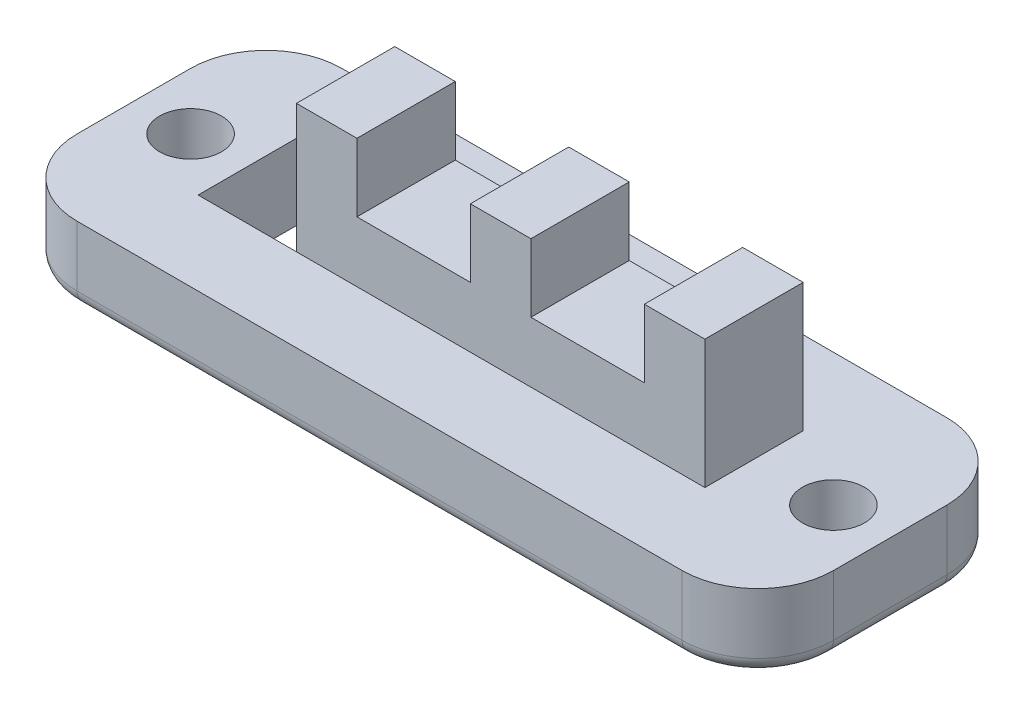
ISO-10303-21;
HEADER;
FILE_DESCRIPTION(('STEP AP214'),'2;1');
FILE_NAME('part.step','',(''),(''),'','','');
FILE_SCHEMA(('AUTOMOTIVE_DESIGN { 1 0 10303 214 1 1 1 1 }'));
ENDSEC;
DATA;
#1=APPLICATION_CONTEXT('core data for automotive mechanical design processes');
#2=APPLICATION_PROTOCOL_DEFINITION('international standard','automotive_design',2000,#1);
#3=PRODUCT_CONTEXT('',#1,'mechanical');
#4=PRODUCT('Part','Part','',(#3));
#5=PRODUCT_RELATED_PRODUCT_CATEGORY('part','',(#4));
#6=PRODUCT_DEFINITION_FORMATION('','',#4);
#7=PRODUCT_DEFINITION_CONTEXT('part definition',#1,'design');
#8=PRODUCT_DEFINITION('design','',#6,#7);
#9=PRODUCT_DEFINITION_SHAPE('','',#8);
#10=(LENGTH_UNIT() NAMED_UNIT(*) SI_UNIT(.MILLI.,.METRE.));
#11=(NAMED_UNIT(*) PLANE_ANGLE_UNIT() SI_UNIT($,.RADIAN.));
#12=(NAMED_UNIT(*) SI_UNIT($,.STERADIAN.) SOLID_ANGLE_UNIT());
#13=UNCERTAINTY_MEASURE_WITH_UNIT(LENGTH_MEASURE(1.E-05),#10,'distance_accuracy_value','');
#14=(GEOMETRIC_REPRESENTATION_CONTEXT(3) GLOBAL_UNCERTAINTY_ASSIGNED_CONTEXT((#13)) GLOBAL_UNIT_ASSIGNED_CONTEXT((#10,
#11,#12)) REPRESENTATION_CONTEXT('',''));
#15=CARTESIAN_POINT('',(0.,0.,0.));
#16=DIRECTION('',(0.,0.,1.));
#17=DIRECTION('',(1.,0.,0.));
#18=AXIS2_PLACEMENT_3D('',#15,#16,#17);
#19=CARTESIAN_POINT('',(0.,4.572,0.));
#20=DIRECTION('',(0.,-1.,0.));
#21=DIRECTION('',(0.,0.,-1.));
#22=AXIS2_PLACEMENT_3D('',#19,#20,#21);
#23=PLANE('',#22);
#24=DIRECTION('',(0.,0.,1.));
#25=VECTOR('',#24,1.);
#26=CARTESIAN_POINT('',(6.096,4.572,-1.651));
#27=LINE('',#26,#25);
#28=CARTESIAN_POINT('',(6.096,4.572,-1.651));
#29=VERTEX_POINT('',#28);
#30=CARTESIAN_POINT('',(6.096,4.572,1.651));
#31=VERTEX_POINT('',#30);
#32=EDGE_CURVE('E246',#29,#31,#27,.T.);
#33=ORIENTED_EDGE('',*,*,#32,.F.);
#34=DIRECTION('',(-1.,0.,0.));
#35=VECTOR('',#34,1.);
#36=CARTESIAN_POINT('',(-8.89,4.572,-1.651));
#37=LINE('',#36,#35);
#38=CARTESIAN_POINT('',(2.286,4.572,-1.651));
#39=VERTEX_POINT('',#38);
#40=EDGE_CURVE('E345',#29,#39,#37,.T.);
#41=ORIENTED_EDGE('',*,*,#40,.T.);
#42=DIRECTION('',(0.,0.,-1.));
#43=VECTOR('',#42,1.);
#44=CARTESIAN_POINT('',(2.286,4.572,-1.651));
#45=LINE('',#44,#43);
#46=CARTESIAN_POINT('',(2.286,4.572,1.651));
#47=VERTEX_POINT('',#46);
#48=EDGE_CURVE('E256',#47,#39,#45,.T.);
#49=ORIENTED_EDGE('',*,*,#48,.F.);
#50=DIRECTION('',(1.,0.,0.));
#51=VECTOR('',#50,1.);
#52=CARTESIAN_POINT('',(-8.89,4.572,1.651));
#53=LINE('',#52,#51);
#54=EDGE_CURVE('E347',#47,#31,#53,.T.);
#55=ORIENTED_EDGE('',*,*,#54,.T.);
#56=EDGE_LOOP('',(#33,#41,#49,#55));
#57=FACE_BOUND('',#56,.T.);
#58=ADVANCED_FACE('F43',(#57),#23,.F.);
#59=DIRECTION('',(0.,0.,1.));
#60=VECTOR('',#59,1.);
#61=CARTESIAN_POINT('',(0.253999999999999,4.572,-1.651));
#62=LINE('',#61,#60);
#63=CARTESIAN_POINT('',(0.253999999999999,4.572,-1.651));
#64=VERTEX_POINT('',#63);
#65=CARTESIAN_POINT('',(0.253999999999999,4.572,1.651));
#66=VERTEX_POINT('',#65);
#67=EDGE_CURVE('E250',#64,#66,#62,.T.);
#68=ORIENTED_EDGE('',*,*,#67,.F.);
#69=CARTESIAN_POINT('',(-3.556,4.572,-1.651));
#70=VERTEX_POINT('',#69);
#71=EDGE_CURVE('E348',#64,#70,#37,.T.);
#72=ORIENTED_EDGE('',*,*,#71,.T.);
#73=DIRECTION('',(0.,0.,-1.));
#74=VECTOR('',#73,1.);
#75=CARTESIAN_POINT('',(-3.556,4.572,-1.651));
#76=LINE('',#75,#74);
#77=CARTESIAN_POINT('',(-3.556,4.572,1.651));
#78=VERTEX_POINT('',#77);
#79=EDGE_CURVE('E284',#78,#70,#76,.T.);
#80=ORIENTED_EDGE('',*,*,#79,.F.);
#81=EDGE_CURVE('E349',#78,#66,#53,.T.);
#82=ORIENTED_EDGE('',*,*,#81,.T.);
#83=EDGE_LOOP('',(#68,#72,#80,#82));
#84=FACE_BOUND('',#83,.T.);
#85=ADVANCED_FACE('F499',(#84),#23,.F.);
#86=CARTESIAN_POINT('',(0.,2.54,0.));
#87=DIRECTION('',(0.,-1.,0.));
#88=DIRECTION('',(0.,0.,-1.));
#89=AXIS2_PLACEMENT_3D('',#86,#87,#88);
#90=PLANE('',#89);
#91=CARTESIAN_POINT('',(-10.795,2.54,0.));
#92=DIRECTION('',(0.,-1.,0.));
#93=DIRECTION('',(0.,0.,-1.));
#94=AXIS2_PLACEMENT_3D('',#91,#92,#93);
#95=CIRCLE('',#94,1.0414);
#96=CARTESIAN_POINT('',(-10.795,2.54,-1.0414));
#97=VERTEX_POINT('',#96);
#98=EDGE_CURVE('E341',#97,#97,#95,.T.);
#99=ORIENTED_EDGE('',*,*,#98,.T.);
#100=EDGE_LOOP('',(#99));
#101=FACE_BOUND('',#100,.T.);
#102=CARTESIAN_POINT('',(10.795,2.54,0.));
#103=DIRECTION('',(0.,-1.,0.));
#104=DIRECTION('',(0.,0.,-1.));
#105=AXIS2_PLACEMENT_3D('',#102,#103,#104);
#106=CIRCLE('',#105,1.0414);
#107=CARTESIAN_POINT('',(10.795,2.54,-1.0414));
#108=VERTEX_POINT('',#107);
#109=EDGE_CURVE('E336',#108,#108,#106,.T.);
#110=ORIENTED_EDGE('',*,*,#109,.T.);
#111=EDGE_LOOP('',(#110));
#112=FACE_BOUND('',#111,.T.);
#113=DIRECTION('',(1.,0.,0.));
#114=VECTOR('',#113,1.);
#115=CARTESIAN_POINT('',(-12.7,2.54,4.445));
#116=LINE('',#115,#114);
#117=CARTESIAN_POINT('',(-10.16,2.54,4.445));
#118=VERTEX_POINT('',#117);
#119=CARTESIAN_POINT('',(10.16,2.54,4.445));
#120=VERTEX_POINT('',#119);
#121=EDGE_CURVE('E376',#118,#120,#116,.T.);
#122=ORIENTED_EDGE('',*,*,#121,.T.);
#123=CARTESIAN_POINT('',(10.16,2.54,1.905));
#124=DIRECTION('',(0.,-1.,0.));
#125=DIRECTION('',(0.,0.,-1.));
#126=AXIS2_PLACEMENT_3D('',#123,#124,#125);
#127=CIRCLE('',#126,2.54);
#128=CARTESIAN_POINT('',(12.7,2.54,1.905));
#129=VERTEX_POINT('',#128);
#130=EDGE_CURVE('E394',#120,#129,#127,.F.);
#131=ORIENTED_EDGE('',*,*,#130,.T.);
#132=DIRECTION('',(0.,0.,-1.));
#133=VECTOR('',#132,1.);
#134=CARTESIAN_POINT('',(12.7,2.54,4.445));
#135=LINE('',#134,#133);
#136=CARTESIAN_POINT('',(12.7,2.54,-1.905));
#137=VERTEX_POINT('',#136);
#138=EDGE_CURVE('E366',#129,#137,#135,.T.);
#139=ORIENTED_EDGE('',*,*,#138,.T.);
#140=CARTESIAN_POINT('',(10.16,2.54,-1.905));
#141=DIRECTION('',(0.,-1.,0.));
#142=DIRECTION('',(0.,0.,-1.));
#143=AXIS2_PLACEMENT_3D('',#140,#141,#142);
#144=CIRCLE('',#143,2.54);
#145=CARTESIAN_POINT('',(10.16,2.54,-4.445));
#146=VERTEX_POINT('',#145);
#147=EDGE_CURVE('E392',#137,#146,#144,.F.);
#148=ORIENTED_EDGE('',*,*,#147,.T.);
#149=DIRECTION('',(-1.,0.,0.));
#150=VECTOR('',#149,1.);
#151=CARTESIAN_POINT('',(-12.7,2.54,-4.445));
#152=LINE('',#151,#150);
#153=CARTESIAN_POINT('',(-10.16,2.54,-4.445));
#154=VERTEX_POINT('',#153);
#155=EDGE_CURVE('E369',#146,#154,#152,.T.);
#156=ORIENTED_EDGE('',*,*,#155,.T.);
#157=CARTESIAN_POINT('',(-10.16,2.54,-1.905));
#158=DIRECTION('',(0.,-1.,0.));
#159=DIRECTION('',(0.,0.,-1.));
#160=AXIS2_PLACEMENT_3D('',#157,#158,#159);
#161=CIRCLE('',#160,2.54);
#162=CARTESIAN_POINT('',(-12.7,2.54,-1.905));
#163=VERTEX_POINT('',#162);
#164=EDGE_CURVE('E388',#154,#163,#161,.F.);
#165=ORIENTED_EDGE('',*,*,#164,.T.);
#166=DIRECTION('',(0.,0.,1.));
#167=VECTOR('',#166,1.);
#168=CARTESIAN_POINT('',(-12.7,2.54,4.445));
#169=LINE('',#168,#167);
#170=CARTESIAN_POINT('',(-12.7,2.54,1.905));
#171=VERTEX_POINT('',#170);
#172=EDGE_CURVE('E373',#163,#171,#169,.T.);
#173=ORIENTED_EDGE('',*,*,#172,.T.);
#174=CARTESIAN_POINT('',(-10.16,2.54,1.905));
#175=DIRECTION('',(0.,-1.,0.));
#176=DIRECTION('',(0.,0.,-1.));
#177=AXIS2_PLACEMENT_3D('',#174,#175,#176);
#178=CIRCLE('',#177,2.54);
#179=EDGE_CURVE('E390',#171,#118,#178,.F.);
#180=ORIENTED_EDGE('',*,*,#179,.T.);
#181=EDGE_LOOP('',(#122,#131,#139,#148,#156,#165,#173,#180));
#182=FACE_BOUND('',#181,.T.);
#183=DIRECTION('',(0.,0.,-1.));
#184=VECTOR('',#183,1.);
#185=CARTESIAN_POINT('',(8.128,2.54,1.651));
#186=LINE('',#185,#184);
#187=CARTESIAN_POINT('',(8.128,2.54,1.651));
#188=VERTEX_POINT('',#187);
#189=CARTESIAN_POINT('',(8.128,2.54,-1.651));
#190=VERTEX_POINT('',#189);
#191=EDGE_CURVE('E344',#188,#190,#186,.T.);
#192=ORIENTED_EDGE('',*,*,#191,.F.);
#193=DIRECTION('',(1.,0.,0.));
#194=VECTOR('',#193,1.);
#195=CARTESIAN_POINT('',(-8.89,2.54,1.651));
#196=LINE('',#195,#194);
#197=CARTESIAN_POINT('',(-5.588,2.54,1.651));
#198=VERTEX_POINT('',#197);
#199=EDGE_CURVE('E359',#198,#188,#196,.T.);
#200=ORIENTED_EDGE('',*,*,#199,.F.);
#201=CARTESIAN_POINT('',(-8.89,2.54,1.651));
#202=VERTEX_POINT('',#201);
#203=EDGE_CURVE('E360',#202,#198,#196,.T.);
#204=ORIENTED_EDGE('',*,*,#203,.F.);
#205=DIRECTION('',(0.,0.,1.));
#206=VECTOR('',#205,1.);
#207=CARTESIAN_POINT('',(-8.89,2.54,1.651));
#208=LINE('',#207,#206);
#209=CARTESIAN_POINT('',(-8.89,2.54,-1.651));
#210=VERTEX_POINT('',#209);
#211=EDGE_CURVE('E357',#210,#202,#208,.T.);
#212=ORIENTED_EDGE('',*,*,#211,.F.);
#213=DIRECTION('',(1.,0.,0.));
#214=VECTOR('',#213,1.);
#215=CARTESIAN_POINT('',(0.,2.54,-1.651));
#216=LINE('',#215,#214);
#217=CARTESIAN_POINT('',(-5.588,2.54,-1.651));
#218=VERTEX_POINT('',#217);
#219=EDGE_CURVE('E329',#210,#218,#216,.T.);
#220=ORIENTED_EDGE('',*,*,#219,.T.);
#221=DIRECTION('',(-1.,0.,0.));
#222=VECTOR('',#221,1.);
#223=CARTESIAN_POINT('',(-8.89,2.54,-1.651));
#224=LINE('',#223,#222);
#225=EDGE_CURVE('E353',#190,#218,#224,.T.);
#226=ORIENTED_EDGE('',*,*,#225,.F.);
#227=EDGE_LOOP('',(#192,#200,#204,#212,#220,#226));
#228=FACE_BOUND('',#227,.T.);
#229=ADVANCED_FACE('F484',(#101,#112,#182,#228),#90,.F.);
#230=CARTESIAN_POINT('',(12.7,2.54,4.445));
#231=DIRECTION('',(-1.,0.,0.));
#232=DIRECTION('',(0.,0.,1.));
#233=AXIS2_PLACEMENT_3D('',#230,#231,#232);
#234=PLANE('',#233);
#235=DIRECTION('',(0.,-1.,0.));
#236=VECTOR('',#235,1.);
#237=CARTESIAN_POINT('',(12.7,2.54,1.905));
#238=LINE('',#237,#236);
#239=CARTESIAN_POINT('',(12.7,0.508,1.905));
#240=VERTEX_POINT('',#239);
#241=EDGE_CURVE('E382',#129,#240,#238,.T.);
#242=ORIENTED_EDGE('',*,*,#241,.T.);
#243=DIRECTION('',(0.,0.,-1.));
#244=VECTOR('',#243,1.);
#245=CARTESIAN_POINT('',(12.7,0.508,-1.905));
#246=LINE('',#245,#244);
#247=CARTESIAN_POINT('',(12.7,0.508,-1.905));
#248=VERTEX_POINT('',#247);
#249=EDGE_CURVE('E434',#240,#248,#246,.T.);
#250=ORIENTED_EDGE('',*,*,#249,.T.);
#251=DIRECTION('',(0.,-1.,0.));
#252=VECTOR('',#251,1.);
#253=CARTESIAN_POINT('',(12.7,2.54,-1.905));
#254=LINE('',#253,#252);
#255=EDGE_CURVE('E380',#248,#137,#254,.F.);
#256=ORIENTED_EDGE('',*,*,#255,.T.);
#257=ORIENTED_EDGE('',*,*,#138,.F.);
#258=EDGE_LOOP('',(#242,#250,#256,#257));
#259=FACE_BOUND('',#258,.T.);
#260=ADVANCED_FACE('F526',(#259),#234,.F.);
#261=CARTESIAN_POINT('',(-12.7,2.54,-4.445));
#262=DIRECTION('',(0.,0.,1.));
#263=DIRECTION('',(1.,0.,0.));
#264=AXIS2_PLACEMENT_3D('',#261,#262,#263);
#265=PLANE('',#264);
#266=DIRECTION('',(0.,-1.,0.));
#267=VECTOR('',#266,1.);
#268=CARTESIAN_POINT('',(10.16,2.54,-4.445));
#269=LINE('',#268,#267);
#270=CARTESIAN_POINT('',(10.16,0.508,-4.445));
#271=VERTEX_POINT('',#270);
#272=EDGE_CURVE('E398',#146,#271,#269,.T.);
#273=ORIENTED_EDGE('',*,*,#272,.T.);
#274=DIRECTION('',(-1.,0.,0.));
#275=VECTOR('',#274,1.);
#276=CARTESIAN_POINT('',(-10.16,0.508,-4.445));
#277=LINE('',#276,#275);
#278=CARTESIAN_POINT('',(-10.16,0.508,-4.445));
#279=VERTEX_POINT('',#278);
#280=EDGE_CURVE('E430',#271,#279,#277,.T.);
#281=ORIENTED_EDGE('',*,*,#280,.T.);
#282=DIRECTION('',(0.,-1.,0.));
#283=VECTOR('',#282,1.);
#284=CARTESIAN_POINT('',(-10.16,2.54,-4.445));
#285=LINE('',#284,#283);
#286=EDGE_CURVE('E396',#279,#154,#285,.F.);
#287=ORIENTED_EDGE('',*,*,#286,.T.);
#288=ORIENTED_EDGE('',*,*,#155,.F.);
#289=EDGE_LOOP('',(#273,#281,#287,#288));
#290=FACE_BOUND('',#289,.T.);
#291=ADVANCED_FACE('F554',(#290),#265,.F.);
#292=CARTESIAN_POINT('',(-12.7,2.54,4.445));
#293=DIRECTION('',(1.,0.,0.));
#294=DIRECTION('',(0.,0.,-1.));
#295=AXIS2_PLACEMENT_3D('',#292,#293,#294);
#296=PLANE('',#295);
#297=DIRECTION('',(0.,-1.,0.));
#298=VECTOR('',#297,1.);
#299=CARTESIAN_POINT('',(-12.7,2.54,-1.905));
#300=LINE('',#299,#298);
#301=CARTESIAN_POINT('',(-12.7,0.508,-1.905));
#302=VERTEX_POINT('',#301);
#303=EDGE_CURVE('E401',#163,#302,#300,.T.);
#304=ORIENTED_EDGE('',*,*,#303,.T.);
#305=DIRECTION('',(0.,0.,1.));
#306=VECTOR('',#305,1.);
#307=CARTESIAN_POINT('',(-12.7,0.508,1.905));
#308=LINE('',#307,#306);
#309=CARTESIAN_POINT('',(-12.7,0.508,1.905));
#310=VERTEX_POINT('',#309);
#311=EDGE_CURVE('E426',#302,#310,#308,.T.);
#312=ORIENTED_EDGE('',*,*,#311,.T.);
#313=DIRECTION('',(0.,-1.,0.));
#314=VECTOR('',#313,1.);
#315=CARTESIAN_POINT('',(-12.7,2.54,1.905));
#316=LINE('',#315,#314);
#317=EDGE_CURVE('E404',#310,#171,#316,.F.);
#318=ORIENTED_EDGE('',*,*,#317,.T.);
#319=ORIENTED_EDGE('',*,*,#172,.F.);
#320=EDGE_LOOP('',(#304,#312,#318,#319));
#321=FACE_BOUND('',#320,.T.);
#322=ADVANCED_FACE('F565',(#321),#296,.F.);
#323=CARTESIAN_POINT('',(-12.7,2.54,4.445));
#324=DIRECTION('',(0.,0.,-1.));
#325=DIRECTION('',(-1.,0.,0.));
#326=AXIS2_PLACEMENT_3D('',#323,#324,#325);
#327=PLANE('',#326);
#328=DIRECTION('',(0.,-1.,0.));
#329=VECTOR('',#328,1.);
#330=CARTESIAN_POINT('',(-10.16,2.54,4.445));
#331=LINE('',#330,#329);
#332=CARTESIAN_POINT('',(-10.16,0.508,4.445));
#333=VERTEX_POINT('',#332);
#334=EDGE_CURVE('E384',#118,#333,#331,.T.);
#335=ORIENTED_EDGE('',*,*,#334,.T.);
#336=DIRECTION('',(1.,0.,0.));
#337=VECTOR('',#336,1.);
#338=CARTESIAN_POINT('',(10.16,0.508,4.445));
#339=LINE('',#338,#337);
#340=CARTESIAN_POINT('',(10.16,0.508,4.445));
#341=VERTEX_POINT('',#340);
#342=EDGE_CURVE('E11',#333,#341,#339,.T.);
#343=ORIENTED_EDGE('',*,*,#342,.T.);
#344=DIRECTION('',(0.,-1.,0.));
#345=VECTOR('',#344,1.);
#346=CARTESIAN_POINT('',(10.16,2.54,4.445));
#347=LINE('',#346,#345);
#348=EDGE_CURVE('E386',#341,#120,#347,.F.);
#349=ORIENTED_EDGE('',*,*,#348,.T.);
#350=ORIENTED_EDGE('',*,*,#121,.F.);
#351=EDGE_LOOP('',(#335,#343,#349,#350));
#352=FACE_BOUND('',#351,.T.);
#353=ADVANCED_FACE('F494',(#352),#327,.F.);
#354=CARTESIAN_POINT('',(0.,0.,0.));
#355=DIRECTION('',(0.,-1.,0.));
#356=DIRECTION('',(0.,0.,-1.));
#357=AXIS2_PLACEMENT_3D('',#354,#355,#356);
#358=PLANE('',#357);
#359=DIRECTION('',(1.,0.,0.));
#360=VECTOR('',#359,1.);
#361=CARTESIAN_POINT('',(-10.16,0.,3.937));
#362=LINE('',#361,#360);
#363=CARTESIAN_POINT('',(10.16,0.,3.937));
#364=VERTEX_POINT('',#363);
#365=CARTESIAN_POINT('',(-10.16,0.,3.937));
#366=VERTEX_POINT('',#365);
#367=EDGE_CURVE('E406',#364,#366,#362,.F.);
#368=ORIENTED_EDGE('',*,*,#367,.T.);
#369=CARTESIAN_POINT('',(-10.16,0.,1.905));
#370=DIRECTION('',(0.,-1.,0.));
#371=DIRECTION('',(0.,0.,-1.));
#372=AXIS2_PLACEMENT_3D('',#369,#370,#371);
#373=CIRCLE('',#372,2.032);
#374=CARTESIAN_POINT('',(-12.192,0.,1.905));
#375=VERTEX_POINT('',#374);
#376=EDGE_CURVE('E420',#366,#375,#373,.T.);
#377=ORIENTED_EDGE('',*,*,#376,.T.);
#378=DIRECTION('',(0.,0.,1.));
#379=VECTOR('',#378,1.);
#380=CARTESIAN_POINT('',(-12.192,0.,-1.905));
#381=LINE('',#380,#379);
#382=CARTESIAN_POINT('',(-12.192,0.,-1.905));
#383=VERTEX_POINT('',#382);
#384=EDGE_CURVE('E418',#375,#383,#381,.F.);
#385=ORIENTED_EDGE('',*,*,#384,.T.);
#386=CARTESIAN_POINT('',(-10.16,0.,-1.905));
#387=DIRECTION('',(0.,-1.,0.));
#388=DIRECTION('',(0.,0.,-1.));
#389=AXIS2_PLACEMENT_3D('',#386,#387,#388);
#390=CIRCLE('',#389,2.032);
#391=CARTESIAN_POINT('',(-10.16,0.,-3.937));
#392=VERTEX_POINT('',#391);
#393=EDGE_CURVE('E416',#383,#392,#390,.T.);
#394=ORIENTED_EDGE('',*,*,#393,.T.);
#395=DIRECTION('',(-1.,0.,0.));
#396=VECTOR('',#395,1.);
#397=CARTESIAN_POINT('',(10.16,0.,-3.937));
#398=LINE('',#397,#396);
#399=CARTESIAN_POINT('',(10.16,0.,-3.937));
#400=VERTEX_POINT('',#399);
#401=EDGE_CURVE('E414',#392,#400,#398,.F.);
#402=ORIENTED_EDGE('',*,*,#401,.T.);
#403=CARTESIAN_POINT('',(10.16,0.,-1.905));
#404=DIRECTION('',(0.,-1.,0.));
#405=DIRECTION('',(0.,0.,-1.));
#406=AXIS2_PLACEMENT_3D('',#403,#404,#405);
#407=CIRCLE('',#406,2.032);
#408=CARTESIAN_POINT('',(12.192,0.,-1.905));
#409=VERTEX_POINT('',#408);
#410=EDGE_CURVE('E412',#400,#409,#407,.T.);
#411=ORIENTED_EDGE('',*,*,#410,.T.);
#412=DIRECTION('',(0.,0.,-1.));
#413=VECTOR('',#412,1.);
#414=CARTESIAN_POINT('',(12.192,0.,1.905));
#415=LINE('',#414,#413);
#416=CARTESIAN_POINT('',(12.192,0.,1.905));
#417=VERTEX_POINT('',#416);
#418=EDGE_CURVE('E410',#409,#417,#415,.F.);
#419=ORIENTED_EDGE('',*,*,#418,.T.);
#420=CARTESIAN_POINT('',(10.16,0.,1.905));
#421=DIRECTION('',(0.,-1.,0.));
#422=DIRECTION('',(0.,0.,-1.));
#423=AXIS2_PLACEMENT_3D('',#420,#421,#422);
#424=CIRCLE('',#423,2.032);
#425=EDGE_CURVE('E408',#417,#364,#424,.T.);
#426=ORIENTED_EDGE('',*,*,#425,.T.);
#427=EDGE_LOOP('',(#368,#377,#385,#394,#402,#411,#419,#426));
#428=FACE_BOUND('',#427,.T.);
#429=DIRECTION('',(1.,0.,0.));
#430=VECTOR('',#429,1.);
#431=CARTESIAN_POINT('',(-8.89,0.,1.651));
#432=LINE('',#431,#430);
#433=CARTESIAN_POINT('',(-8.89,0.,1.651));
#434=VERTEX_POINT('',#433);
#435=CARTESIAN_POINT('',(-5.588,0.,1.651));
#436=VERTEX_POINT('',#435);
#437=EDGE_CURVE('E303',#434,#436,#432,.T.);
#438=ORIENTED_EDGE('',*,*,#437,.T.);
#439=DIRECTION('',(0.,0.,-1.));
#440=VECTOR('',#439,1.);
#441=CARTESIAN_POINT('',(-5.588,0.,1.651));
#442=LINE('',#441,#440);
#443=CARTESIAN_POINT('',(-5.588,0.,-1.651));
#444=VERTEX_POINT('',#443);
#445=EDGE_CURVE('E316',#436,#444,#442,.T.);
#446=ORIENTED_EDGE('',*,*,#445,.T.);
#447=DIRECTION('',(-1.,0.,0.));
#448=VECTOR('',#447,1.);
#449=CARTESIAN_POINT('',(-8.89,0.,-1.651));
#450=LINE('',#449,#448);
#451=CARTESIAN_POINT('',(-8.89,0.,-1.651));
#452=VERTEX_POINT('',#451);
#453=EDGE_CURVE('E312',#444,#452,#450,.T.);
#454=ORIENTED_EDGE('',*,*,#453,.T.);
#455=DIRECTION('',(0.,0.,1.));
#456=VECTOR('',#455,1.);
#457=CARTESIAN_POINT('',(-8.89,0.,1.651));
#458=LINE('',#457,#456);
#459=EDGE_CURVE('E307',#452,#434,#458,.T.);
#460=ORIENTED_EDGE('',*,*,#459,.T.);
#461=EDGE_LOOP('',(#438,#446,#454,#460));
#462=FACE_BOUND('',#461,.T.);
#463=CARTESIAN_POINT('',(-10.795,0.,0.));
#464=DIRECTION('',(0.,-1.,0.));
#465=DIRECTION('',(0.,0.,-1.));
#466=AXIS2_PLACEMENT_3D('',#463,#464,#465);
#467=CIRCLE('',#466,1.0414);
#468=CARTESIAN_POINT('',(-10.795,0.,-1.0414));
#469=VERTEX_POINT('',#468);
#470=EDGE_CURVE('E333',#469,#469,#467,.T.);
#471=ORIENTED_EDGE('',*,*,#470,.F.);
#472=EDGE_LOOP('',(#471));
#473=FACE_BOUND('',#472,.T.);
#474=CARTESIAN_POINT('',(10.795,0.,0.));
#475=DIRECTION('',(0.,-1.,0.));
#476=DIRECTION('',(0.,0.,-1.));
#477=AXIS2_PLACEMENT_3D('',#474,#475,#476);
#478=CIRCLE('',#477,1.0414);
#479=CARTESIAN_POINT('',(10.795,0.,-1.0414));
#480=VERTEX_POINT('',#479);
#481=EDGE_CURVE('E332',#480,#480,#478,.T.);
#482=ORIENTED_EDGE('',*,*,#481,.F.);
#483=EDGE_LOOP('',(#482));
#484=FACE_BOUND('',#483,.T.);
#485=ADVANCED_FACE('F487',(#428,#462,#473,#484),#358,.T.);
#486=CARTESIAN_POINT('',(8.128,4.572,1.651));
#487=DIRECTION('',(-1.,0.,0.));
#488=DIRECTION('',(0.,0.,1.));
#489=AXIS2_PLACEMENT_3D('',#486,#487,#488);
#490=PLANE('',#489);
#491=ORIENTED_EDGE('',*,*,#191,.T.);
#492=DIRECTION('',(0.,-1.,0.));
#493=VECTOR('',#492,1.);
#494=CARTESIAN_POINT('',(8.128,4.572,-1.651));
#495=LINE('',#494,#493);
#496=CARTESIAN_POINT('',(8.128,6.858,-1.651));
#497=VERTEX_POINT('',#496);
#498=EDGE_CURVE('E363',#497,#190,#495,.T.);
#499=ORIENTED_EDGE('',*,*,#498,.F.);
#500=DIRECTION('',(0.,0.,-1.));
#501=VECTOR('',#500,1.);
#502=CARTESIAN_POINT('',(8.128,6.858,-1.651));
#503=LINE('',#502,#501);
#504=CARTESIAN_POINT('',(8.128,6.858,1.651));
#505=VERTEX_POINT('',#504);
#506=EDGE_CURVE('E236',#505,#497,#503,.T.);
#507=ORIENTED_EDGE('',*,*,#506,.F.);
#508=DIRECTION('',(0.,-1.,0.));
#509=VECTOR('',#508,1.);
#510=CARTESIAN_POINT('',(8.128,4.572,1.651));
#511=LINE('',#510,#509);
#512=EDGE_CURVE('E232',#505,#188,#511,.T.);
#513=ORIENTED_EDGE('',*,*,#512,.T.);
#514=EDGE_LOOP('',(#491,#499,#507,#513));
#515=FACE_BOUND('',#514,.T.);
#516=ADVANCED_FACE('F485',(#515),#490,.F.);
#517=CARTESIAN_POINT('',(-8.89,4.572,-1.651));
#518=DIRECTION('',(0.,0.,1.));
#519=DIRECTION('',(1.,0.,0.));
#520=AXIS2_PLACEMENT_3D('',#517,#518,#519);
#521=PLANE('',#520);
#522=ORIENTED_EDGE('',*,*,#225,.T.);
#523=DIRECTION('',(0.,1.,0.));
#524=VECTOR('',#523,1.);
#525=CARTESIAN_POINT('',(-5.588,-4.66973318295596,-1.651));
#526=LINE('',#525,#524);
#527=CARTESIAN_POINT('',(-5.588,6.858,-1.651));
#528=VERTEX_POINT('',#527);
#529=EDGE_CURVE('E319',#218,#528,#526,.T.);
#530=ORIENTED_EDGE('',*,*,#529,.T.);
#531=DIRECTION('',(-1.,0.,0.));
#532=VECTOR('',#531,1.);
#533=CARTESIAN_POINT('',(-5.588,6.858,-1.651));
#534=LINE('',#533,#532);
#535=CARTESIAN_POINT('',(-3.556,6.858,-1.651));
#536=VERTEX_POINT('',#535);
#537=EDGE_CURVE('E292',#536,#528,#534,.T.);
#538=ORIENTED_EDGE('',*,*,#537,.F.);
#539=DIRECTION('',(0.,-1.,0.));
#540=VECTOR('',#539,1.);
#541=CARTESIAN_POINT('',(-3.556,6.858,-1.651));
#542=LINE('',#541,#540);
#543=EDGE_CURVE('E295',#536,#70,#542,.T.);
#544=ORIENTED_EDGE('',*,*,#543,.T.);
#545=ORIENTED_EDGE('',*,*,#71,.F.);
#546=DIRECTION('',(0.,-1.,0.));
#547=VECTOR('',#546,1.);
#548=CARTESIAN_POINT('',(0.253999999999999,6.858,-1.651));
#549=LINE('',#548,#547);
#550=CARTESIAN_POINT('',(0.253999999999999,6.858,-1.651));
#551=VERTEX_POINT('',#550);
#552=EDGE_CURVE('E269',#551,#64,#549,.T.);
#553=ORIENTED_EDGE('',*,*,#552,.F.);
#554=DIRECTION('',(-1.,0.,0.));
#555=VECTOR('',#554,1.);
#556=CARTESIAN_POINT('',(0.253999999999999,6.858,-1.651));
#557=LINE('',#556,#555);
#558=CARTESIAN_POINT('',(2.286,6.858,-1.651));
#559=VERTEX_POINT('',#558);
#560=EDGE_CURVE('E268',#559,#551,#557,.T.);
#561=ORIENTED_EDGE('',*,*,#560,.F.);
#562=DIRECTION('',(0.,-1.,0.));
#563=VECTOR('',#562,1.);
#564=CARTESIAN_POINT('',(2.286,6.858,-1.651));
#565=LINE('',#564,#563);
#566=EDGE_CURVE('E275',#559,#39,#565,.T.);
#567=ORIENTED_EDGE('',*,*,#566,.T.);
#568=ORIENTED_EDGE('',*,*,#40,.F.);
#569=DIRECTION('',(0.,-1.,0.));
#570=VECTOR('',#569,1.);
#571=CARTESIAN_POINT('',(6.096,6.858,-1.651));
#572=LINE('',#571,#570);
#573=CARTESIAN_POINT('',(6.096,6.858,-1.651));
#574=VERTEX_POINT('',#573);
#575=EDGE_CURVE('E251',#574,#29,#572,.T.);
#576=ORIENTED_EDGE('',*,*,#575,.F.);
#577=DIRECTION('',(-1.,0.,0.));
#578=VECTOR('',#577,1.);
#579=CARTESIAN_POINT('',(6.096,6.858,-1.651));
#580=LINE('',#579,#578);
#581=EDGE_CURVE('E242',#497,#574,#580,.T.);
#582=ORIENTED_EDGE('',*,*,#581,.F.);
#583=ORIENTED_EDGE('',*,*,#498,.T.);
#584=EDGE_LOOP('',(#522,#530,#538,#544,#545,#553,#561,#567,#568,#576,#582,#583));
#585=FACE_BOUND('',#584,.T.);
#586=ADVANCED_FACE('F467',(#585),#521,.F.);
#587=CARTESIAN_POINT('',(-8.89,4.572,1.651));
#588=DIRECTION('',(0.,0.,-1.));
#589=DIRECTION('',(-1.,0.,0.));
#590=AXIS2_PLACEMENT_3D('',#587,#588,#589);
#591=PLANE('',#590);
#592=ORIENTED_EDGE('',*,*,#81,.F.);
#593=DIRECTION('',(0.,-1.,0.));
#594=VECTOR('',#593,1.);
#595=CARTESIAN_POINT('',(-3.556,6.858,1.651));
#596=LINE('',#595,#594);
#597=CARTESIAN_POINT('',(-3.556,6.858,1.651));
#598=VERTEX_POINT('',#597);
#599=EDGE_CURVE('E300',#598,#78,#596,.T.);
#600=ORIENTED_EDGE('',*,*,#599,.F.);
#601=DIRECTION('',(1.,0.,0.));
#602=VECTOR('',#601,1.);
#603=CARTESIAN_POINT('',(-5.588,6.858,1.651));
#604=LINE('',#603,#602);
#605=CARTESIAN_POINT('',(-5.588,6.858,1.651));
#606=VERTEX_POINT('',#605);
#607=EDGE_CURVE('E288',#606,#598,#604,.T.);
#608=ORIENTED_EDGE('',*,*,#607,.F.);
#609=DIRECTION('',(0.,1.,0.));
#610=VECTOR('',#609,1.);
#611=CARTESIAN_POINT('',(-5.588,-4.66973318295596,1.651));
#612=LINE('',#611,#610);
#613=EDGE_CURVE('E306',#198,#606,#612,.T.);
#614=ORIENTED_EDGE('',*,*,#613,.F.);
#615=ORIENTED_EDGE('',*,*,#199,.T.);
#616=ORIENTED_EDGE('',*,*,#512,.F.);
#617=DIRECTION('',(1.,0.,0.));
#618=VECTOR('',#617,1.);
#619=CARTESIAN_POINT('',(6.096,6.858,1.651));
#620=LINE('',#619,#618);
#621=CARTESIAN_POINT('',(6.096,6.858,1.651));
#622=VERTEX_POINT('',#621);
#623=EDGE_CURVE('E224',#622,#505,#620,.T.);
#624=ORIENTED_EDGE('',*,*,#623,.F.);
#625=DIRECTION('',(0.,-1.,0.));
#626=VECTOR('',#625,1.);
#627=CARTESIAN_POINT('',(6.096,6.858,1.651));
#628=LINE('',#627,#626);
#629=EDGE_CURVE('E229',#622,#31,#628,.T.);
#630=ORIENTED_EDGE('',*,*,#629,.T.);
#631=ORIENTED_EDGE('',*,*,#54,.F.);
#632=DIRECTION('',(0.,-1.,0.));
#633=VECTOR('',#632,1.);
#634=CARTESIAN_POINT('',(2.286,6.858,1.651));
#635=LINE('',#634,#633);
#636=CARTESIAN_POINT('',(2.286,6.858,1.651));
#637=VERTEX_POINT('',#636);
#638=EDGE_CURVE('E278',#637,#47,#635,.T.);
#639=ORIENTED_EDGE('',*,*,#638,.F.);
#640=DIRECTION('',(1.,0.,0.));
#641=VECTOR('',#640,1.);
#642=CARTESIAN_POINT('',(0.253999999999999,6.858,1.651));
#643=LINE('',#642,#641);
#644=CARTESIAN_POINT('',(0.253999999999999,6.858,1.651));
#645=VERTEX_POINT('',#644);
#646=EDGE_CURVE('E264',#645,#637,#643,.T.);
#647=ORIENTED_EDGE('',*,*,#646,.F.);
#648=DIRECTION('',(0.,-1.,0.));
#649=VECTOR('',#648,1.);
#650=CARTESIAN_POINT('',(0.253999999999999,6.858,1.651));
#651=LINE('',#650,#649);
#652=EDGE_CURVE('E281',#645,#66,#651,.T.);
#653=ORIENTED_EDGE('',*,*,#652,.T.);
#654=EDGE_LOOP('',(#592,#600,#608,#614,#615,#616,#624,#630,#631,#639,#647,#653));
#655=FACE_BOUND('',#654,.T.);
#656=ADVANCED_FACE('F227',(#655),#591,.F.);
#657=CARTESIAN_POINT('',(10.795,4.572,0.));
#658=DIRECTION('',(0.,-1.,0.));
#659=DIRECTION('',(0.,0.,-1.));
#660=AXIS2_PLACEMENT_3D('',#657,#658,#659);
#661=CYLINDRICAL_SURFACE('',#660,1.0414);
#662=ORIENTED_EDGE('',*,*,#481,.T.);
#663=EDGE_LOOP('',(#662));
#664=FACE_BOUND('',#663,.T.);
#665=ORIENTED_EDGE('',*,*,#109,.F.);
#666=EDGE_LOOP('',(#665));
#667=FACE_BOUND('',#666,.T.);
#668=ADVANCED_FACE('F507',(#664,#667),#661,.F.);
#669=CARTESIAN_POINT('',(-10.795,4.572,0.));
#670=DIRECTION('',(0.,-1.,0.));
#671=DIRECTION('',(0.,0.,-1.));
#672=AXIS2_PLACEMENT_3D('',#669,#670,#671);
#673=CYLINDRICAL_SURFACE('',#672,1.0414);
#674=ORIENTED_EDGE('',*,*,#470,.T.);
#675=EDGE_LOOP('',(#674));
#676=FACE_BOUND('',#675,.T.);
#677=ORIENTED_EDGE('',*,*,#98,.F.);
#678=EDGE_LOOP('',(#677));
#679=FACE_BOUND('',#678,.T.);
#680=ADVANCED_FACE('F513',(#676,#679),#673,.F.);
#681=CARTESIAN_POINT('',(-8.89,-4.66973318295596,1.651));
#682=DIRECTION('',(0.,0.,1.));
#683=DIRECTION('',(1.,0.,0.));
#684=AXIS2_PLACEMENT_3D('',#681,#682,#683);
#685=PLANE('',#684);
#686=EDGE_CURVE('E320',#436,#198,#612,.T.);
#687=ORIENTED_EDGE('',*,*,#686,.F.);
#688=ORIENTED_EDGE('',*,*,#437,.F.);
#689=DIRECTION('',(0.,1.,0.));
#690=VECTOR('',#689,1.);
#691=CARTESIAN_POINT('',(-8.89,-4.66973318295596,1.651));
#692=LINE('',#691,#690);
#693=EDGE_CURVE('E310',#434,#202,#692,.T.);
#694=ORIENTED_EDGE('',*,*,#693,.T.);
#695=ORIENTED_EDGE('',*,*,#203,.T.);
#696=EDGE_LOOP('',(#687,#688,#694,#695));
#697=FACE_BOUND('',#696,.T.);
#698=ADVANCED_FACE('F518',(#697),#685,.F.);
#699=CARTESIAN_POINT('',(-8.89,-4.66973318295596,-1.651));
#700=DIRECTION('',(0.,0.,-1.));
#701=DIRECTION('',(-1.,0.,0.));
#702=AXIS2_PLACEMENT_3D('',#699,#700,#701);
#703=PLANE('',#702);
#704=DIRECTION('',(0.,1.,0.));
#705=VECTOR('',#704,1.);
#706=CARTESIAN_POINT('',(-8.89,-4.66973318295596,-1.651));
#707=LINE('',#706,#705);
#708=EDGE_CURVE('E311',#452,#210,#707,.T.);
#709=ORIENTED_EDGE('',*,*,#708,.F.);
#710=ORIENTED_EDGE('',*,*,#453,.F.);
#711=EDGE_CURVE('E315',#444,#218,#526,.T.);
#712=ORIENTED_EDGE('',*,*,#711,.T.);
#713=ORIENTED_EDGE('',*,*,#219,.F.);
#714=EDGE_LOOP('',(#709,#710,#712,#713));
#715=FACE_BOUND('',#714,.T.);
#716=ADVANCED_FACE('F704',(#715),#703,.F.);
#717=CARTESIAN_POINT('',(-8.89,-4.66973318295596,1.651));
#718=DIRECTION('',(-1.,0.,0.));
#719=DIRECTION('',(0.,0.,1.));
#720=AXIS2_PLACEMENT_3D('',#717,#718,#719);
#721=PLANE('',#720);
#722=ORIENTED_EDGE('',*,*,#693,.F.);
#723=ORIENTED_EDGE('',*,*,#459,.F.);
#724=ORIENTED_EDGE('',*,*,#708,.T.);
#725=ORIENTED_EDGE('',*,*,#211,.T.);
#726=EDGE_LOOP('',(#722,#723,#724,#725));
#727=FACE_BOUND('',#726,.T.);
#728=ADVANCED_FACE('F695',(#727),#721,.F.);
#729=CARTESIAN_POINT('',(-5.588,-4.66973318295596,1.651));
#730=DIRECTION('',(1.,0.,0.));
#731=DIRECTION('',(0.,0.,-1.));
#732=AXIS2_PLACEMENT_3D('',#729,#730,#731);
#733=PLANE('',#732);
#734=ORIENTED_EDGE('',*,*,#686,.T.);
#735=ORIENTED_EDGE('',*,*,#613,.T.);
#736=DIRECTION('',(0.,0.,1.));
#737=VECTOR('',#736,1.);
#738=CARTESIAN_POINT('',(-5.588,6.858,-1.651));
#739=LINE('',#738,#737);
#740=EDGE_CURVE('E285',#528,#606,#739,.T.);
#741=ORIENTED_EDGE('',*,*,#740,.F.);
#742=ORIENTED_EDGE('',*,*,#529,.F.);
#743=ORIENTED_EDGE('',*,*,#711,.F.);
#744=ORIENTED_EDGE('',*,*,#445,.F.);
#745=EDGE_LOOP('',(#734,#735,#741,#742,#743,#744));
#746=FACE_BOUND('',#745,.T.);
#747=ADVANCED_FACE('F687',(#746),#733,.F.);
#748=CARTESIAN_POINT('',(-3.556,6.858,-1.651));
#749=DIRECTION('',(-1.,0.,0.));
#750=DIRECTION('',(0.,0.,1.));
#751=AXIS2_PLACEMENT_3D('',#748,#749,#750);
#752=PLANE('',#751);
#753=ORIENTED_EDGE('',*,*,#79,.T.);
#754=ORIENTED_EDGE('',*,*,#543,.F.);
#755=DIRECTION('',(0.,0.,-1.));
#756=VECTOR('',#755,1.);
#757=CARTESIAN_POINT('',(-3.556,6.858,-1.651));
#758=LINE('',#757,#756);
#759=EDGE_CURVE('E290',#598,#536,#758,.T.);
#760=ORIENTED_EDGE('',*,*,#759,.F.);
#761=ORIENTED_EDGE('',*,*,#599,.T.);
#762=EDGE_LOOP('',(#753,#754,#760,#761));
#763=FACE_BOUND('',#762,.T.);
#764=ADVANCED_FACE('F679',(#763),#752,.F.);
#765=CARTESIAN_POINT('',(0.,6.858,0.));
#766=DIRECTION('',(0.,1.,0.));
#767=DIRECTION('',(0.,0.,1.));
#768=AXIS2_PLACEMENT_3D('',#765,#766,#767);
#769=PLANE('',#768);
#770=ORIENTED_EDGE('',*,*,#740,.T.);
#771=ORIENTED_EDGE('',*,*,#607,.T.);
#772=ORIENTED_EDGE('',*,*,#759,.T.);
#773=ORIENTED_EDGE('',*,*,#537,.T.);
#774=EDGE_LOOP('',(#770,#771,#772,#773));
#775=FACE_BOUND('',#774,.T.);
#776=ADVANCED_FACE('F671',(#775),#769,.T.);
#777=CARTESIAN_POINT('',(0.253999999999999,6.858,-1.651));
#778=DIRECTION('',(1.,0.,0.));
#779=DIRECTION('',(0.,0.,-1.));
#780=AXIS2_PLACEMENT_3D('',#777,#778,#779);
#781=PLANE('',#780);
#782=ORIENTED_EDGE('',*,*,#67,.T.);
#783=ORIENTED_EDGE('',*,*,#652,.F.);
#784=DIRECTION('',(0.,0.,1.));
#785=VECTOR('',#784,1.);
#786=CARTESIAN_POINT('',(0.253999999999999,6.858,-1.651));
#787=LINE('',#786,#785);
#788=EDGE_CURVE('E261',#551,#645,#787,.T.);
#789=ORIENTED_EDGE('',*,*,#788,.F.);
#790=ORIENTED_EDGE('',*,*,#552,.T.);
#791=EDGE_LOOP('',(#782,#783,#789,#790));
#792=FACE_BOUND('',#791,.T.);
#793=ADVANCED_FACE('F664',(#792),#781,.F.);
#794=CARTESIAN_POINT('',(2.286,6.858,-1.651));
#795=DIRECTION('',(-1.,0.,0.));
#796=DIRECTION('',(0.,0.,1.));
#797=AXIS2_PLACEMENT_3D('',#794,#795,#796);
#798=PLANE('',#797);
#799=ORIENTED_EDGE('',*,*,#48,.T.);
#800=ORIENTED_EDGE('',*,*,#566,.F.);
#801=DIRECTION('',(0.,0.,-1.));
#802=VECTOR('',#801,1.);
#803=CARTESIAN_POINT('',(2.286,6.858,-1.651));
#804=LINE('',#803,#802);
#805=EDGE_CURVE('E266',#637,#559,#804,.T.);
#806=ORIENTED_EDGE('',*,*,#805,.F.);
#807=ORIENTED_EDGE('',*,*,#638,.T.);
#808=EDGE_LOOP('',(#799,#800,#806,#807));
#809=FACE_BOUND('',#808,.T.);
#810=ADVANCED_FACE('F474',(#809),#798,.F.);
#811=CARTESIAN_POINT('',(0.,6.858,0.));
#812=DIRECTION('',(0.,1.,0.));
#813=DIRECTION('',(0.,0.,1.));
#814=AXIS2_PLACEMENT_3D('',#811,#812,#813);
#815=PLANE('',#814);
#816=ORIENTED_EDGE('',*,*,#788,.T.);
#817=ORIENTED_EDGE('',*,*,#646,.T.);
#818=ORIENTED_EDGE('',*,*,#805,.T.);
#819=ORIENTED_EDGE('',*,*,#560,.T.);
#820=EDGE_LOOP('',(#816,#817,#818,#819));
#821=FACE_BOUND('',#820,.T.);
#822=ADVANCED_FACE('F650',(#821),#815,.T.);
#823=CARTESIAN_POINT('',(6.096,6.858,-1.651));
#824=DIRECTION('',(1.,0.,0.));
#825=DIRECTION('',(0.,0.,-1.));
#826=AXIS2_PLACEMENT_3D('',#823,#824,#825);
#827=PLANE('',#826);
#828=ORIENTED_EDGE('',*,*,#32,.T.);
#829=ORIENTED_EDGE('',*,*,#629,.F.);
#830=DIRECTION('',(0.,0.,1.));
#831=VECTOR('',#830,1.);
#832=CARTESIAN_POINT('',(6.096,6.858,-1.651));
#833=LINE('',#832,#831);
#834=EDGE_CURVE('E237',#574,#622,#833,.T.);
#835=ORIENTED_EDGE('',*,*,#834,.F.);
#836=ORIENTED_EDGE('',*,*,#575,.T.);
#837=EDGE_LOOP('',(#828,#829,#835,#836));
#838=FACE_BOUND('',#837,.T.);
#839=ADVANCED_FACE('F248',(#838),#827,.F.);
#840=CARTESIAN_POINT('',(0.,6.858,0.));
#841=DIRECTION('',(0.,1.,0.));
#842=DIRECTION('',(0.,0.,1.));
#843=AXIS2_PLACEMENT_3D('',#840,#841,#842);
#844=PLANE('',#843);
#845=ORIENTED_EDGE('',*,*,#834,.T.);
#846=ORIENTED_EDGE('',*,*,#623,.T.);
#847=ORIENTED_EDGE('',*,*,#506,.T.);
#848=ORIENTED_EDGE('',*,*,#581,.T.);
#849=EDGE_LOOP('',(#845,#846,#847,#848));
#850=FACE_BOUND('',#849,.T.);
#851=ADVANCED_FACE('F240',(#850),#844,.T.);
#852=CARTESIAN_POINT('',(10.16,2.54,1.905));
#853=DIRECTION('',(0.,-1.,0.));
#854=DIRECTION('',(0.,0.,-1.));
#855=AXIS2_PLACEMENT_3D('',#852,#853,#854);
#856=CYLINDRICAL_SURFACE('',#855,2.54);
#857=ORIENTED_EDGE('',*,*,#348,.F.);
#858=CARTESIAN_POINT('',(10.16,0.508,1.905));
#859=DIRECTION('',(0.,-1.,0.));
#860=DIRECTION('',(0.,0.,-1.));
#861=AXIS2_PLACEMENT_3D('',#858,#859,#860);
#862=CIRCLE('',#861,2.54);
#863=EDGE_CURVE('E52',#341,#240,#862,.F.);
#864=ORIENTED_EDGE('',*,*,#863,.T.);
#865=ORIENTED_EDGE('',*,*,#241,.F.);
#866=ORIENTED_EDGE('',*,*,#130,.F.);
#867=EDGE_LOOP('',(#857,#864,#865,#866));
#868=FACE_BOUND('',#867,.T.);
#869=ADVANCED_FACE('F533',(#868),#856,.T.);
#870=CARTESIAN_POINT('',(10.16,2.54,-1.905));
#871=DIRECTION('',(0.,-1.,0.));
#872=DIRECTION('',(0.,0.,-1.));
#873=AXIS2_PLACEMENT_3D('',#870,#871,#872);
#874=CYLINDRICAL_SURFACE('',#873,2.54);
#875=ORIENTED_EDGE('',*,*,#255,.F.);
#876=CARTESIAN_POINT('',(10.16,0.508,-1.905));
#877=DIRECTION('',(0.,-1.,0.));
#878=DIRECTION('',(0.,0.,-1.));
#879=AXIS2_PLACEMENT_3D('',#876,#877,#878);
#880=CIRCLE('',#879,2.54);
#881=EDGE_CURVE('E432',#248,#271,#880,.F.);
#882=ORIENTED_EDGE('',*,*,#881,.T.);
#883=ORIENTED_EDGE('',*,*,#272,.F.);
#884=ORIENTED_EDGE('',*,*,#147,.F.);
#885=EDGE_LOOP('',(#875,#882,#883,#884));
#886=FACE_BOUND('',#885,.T.);
#887=ADVANCED_FACE('F550',(#886),#874,.T.);
#888=CARTESIAN_POINT('',(-10.16,2.54,1.905));
#889=DIRECTION('',(0.,-1.,0.));
#890=DIRECTION('',(0.,0.,-1.));
#891=AXIS2_PLACEMENT_3D('',#888,#889,#890);
#892=CYLINDRICAL_SURFACE('',#891,2.54);
#893=ORIENTED_EDGE('',*,*,#317,.F.);
#894=CARTESIAN_POINT('',(-10.16,0.508,1.905));
#895=DIRECTION('',(0.,-1.,0.));
#896=DIRECTION('',(0.,0.,-1.));
#897=AXIS2_PLACEMENT_3D('',#894,#895,#896);
#898=CIRCLE('',#897,2.54);
#899=EDGE_CURVE('E423',#310,#333,#898,.F.);
#900=ORIENTED_EDGE('',*,*,#899,.T.);
#901=ORIENTED_EDGE('',*,*,#334,.F.);
#902=ORIENTED_EDGE('',*,*,#179,.F.);
#903=EDGE_LOOP('',(#893,#900,#901,#902));
#904=FACE_BOUND('',#903,.T.);
#905=ADVANCED_FACE('F580',(#904),#892,.T.);
#906=CARTESIAN_POINT('',(-10.16,2.54,-1.905));
#907=DIRECTION('',(0.,-1.,0.));
#908=DIRECTION('',(0.,0.,-1.));
#909=AXIS2_PLACEMENT_3D('',#906,#907,#908);
#910=CYLINDRICAL_SURFACE('',#909,2.54);
#911=ORIENTED_EDGE('',*,*,#286,.F.);
#912=CARTESIAN_POINT('',(-10.16,0.508,-1.905));
#913=DIRECTION('',(0.,-1.,0.));
#914=DIRECTION('',(0.,0.,-1.));
#915=AXIS2_PLACEMENT_3D('',#912,#913,#914);
#916=CIRCLE('',#915,2.54);
#917=EDGE_CURVE('E428',#279,#302,#916,.F.);
#918=ORIENTED_EDGE('',*,*,#917,.T.);
#919=ORIENTED_EDGE('',*,*,#303,.F.);
#920=ORIENTED_EDGE('',*,*,#164,.F.);
#921=EDGE_LOOP('',(#911,#918,#919,#920));
#922=FACE_BOUND('',#921,.T.);
#923=ADVANCED_FACE('F560',(#922),#910,.T.);
#924=CARTESIAN_POINT('',(10.16,0.508,-1.905));
#925=DIRECTION('',(0.,-1.,0.));
#926=DIRECTION('',(0.,0.,-1.));
#927=AXIS2_PLACEMENT_3D('',#924,#925,#926);
#928=TOROIDAL_SURFACE('',#927,2.032,0.508);
#929=CARTESIAN_POINT('',(10.16,0.508,-3.937));
#930=DIRECTION('',(-1.,0.,0.));
#931=DIRECTION('',(0.,0.,1.));
#932=AXIS2_PLACEMENT_3D('',#929,#930,#931);
#933=CIRCLE('',#932,0.508);
#934=EDGE_CURVE('E452',#271,#400,#933,.T.);
#935=ORIENTED_EDGE('',*,*,#934,.F.);
#936=ORIENTED_EDGE('',*,*,#881,.F.);
#937=CARTESIAN_POINT('',(12.192,0.508,-1.905));
#938=DIRECTION('',(0.,0.,1.));
#939=DIRECTION('',(1.,0.,0.));
#940=AXIS2_PLACEMENT_3D('',#937,#938,#939);
#941=CIRCLE('',#940,0.508);
#942=EDGE_CURVE('E47',#409,#248,#941,.T.);
#943=ORIENTED_EDGE('',*,*,#942,.F.);
#944=ORIENTED_EDGE('',*,*,#410,.F.);
#945=EDGE_LOOP('',(#935,#936,#943,#944));
#946=FACE_BOUND('',#945,.T.);
#947=ADVANCED_FACE('F45',(#946),#928,.T.);
#948=CARTESIAN_POINT('',(12.192,0.508,4.445));
#949=DIRECTION('',(0.,0.,1.));
#950=DIRECTION('',(1.,0.,0.));
#951=AXIS2_PLACEMENT_3D('',#948,#949,#950);
#952=CYLINDRICAL_SURFACE('',#951,0.508);
#953=ORIENTED_EDGE('',*,*,#942,.T.);
#954=ORIENTED_EDGE('',*,*,#249,.F.);
#955=CARTESIAN_POINT('',(12.192,0.508,1.905));
#956=DIRECTION('',(0.,0.,1.));
#957=DIRECTION('',(1.,0.,0.));
#958=AXIS2_PLACEMENT_3D('',#955,#956,#957);
#959=CIRCLE('',#958,0.508);
#960=EDGE_CURVE('E450',#417,#240,#959,.T.);
#961=ORIENTED_EDGE('',*,*,#960,.F.);
#962=ORIENTED_EDGE('',*,*,#418,.F.);
#963=EDGE_LOOP('',(#953,#954,#961,#962));
#964=FACE_BOUND('',#963,.T.);
#965=ADVANCED_FACE('F537',(#964),#952,.T.);
#966=CARTESIAN_POINT('',(-12.7,0.508,-3.937));
#967=DIRECTION('',(1.,0.,0.));
#968=DIRECTION('',(0.,0.,-1.));
#969=AXIS2_PLACEMENT_3D('',#966,#967,#968);
#970=CYLINDRICAL_SURFACE('',#969,0.508);
#971=ORIENTED_EDGE('',*,*,#934,.T.);
#972=ORIENTED_EDGE('',*,*,#401,.F.);
#973=CARTESIAN_POINT('',(-10.16,0.508,-3.937));
#974=DIRECTION('',(-1.,0.,0.));
#975=DIRECTION('',(0.,0.,1.));
#976=AXIS2_PLACEMENT_3D('',#973,#974,#975);
#977=CIRCLE('',#976,0.508);
#978=EDGE_CURVE('E447',#279,#392,#977,.T.);
#979=ORIENTED_EDGE('',*,*,#978,.F.);
#980=ORIENTED_EDGE('',*,*,#280,.F.);
#981=EDGE_LOOP('',(#971,#972,#979,#980));
#982=FACE_BOUND('',#981,.T.);
#983=ADVANCED_FACE('F612',(#982),#970,.T.);
#984=CARTESIAN_POINT('',(10.16,0.508,1.905));
#985=DIRECTION('',(0.,-1.,0.));
#986=DIRECTION('',(0.,0.,-1.));
#987=AXIS2_PLACEMENT_3D('',#984,#985,#986);
#988=TOROIDAL_SURFACE('',#987,2.032,0.508);
#989=ORIENTED_EDGE('',*,*,#960,.T.);
#990=ORIENTED_EDGE('',*,*,#863,.F.);
#991=CARTESIAN_POINT('',(10.16,0.508,3.937));
#992=DIRECTION('',(-1.,0.,0.));
#993=DIRECTION('',(0.,0.,1.));
#994=AXIS2_PLACEMENT_3D('',#991,#992,#993);
#995=CIRCLE('',#994,0.508);
#996=EDGE_CURVE('E444',#364,#341,#995,.T.);
#997=ORIENTED_EDGE('',*,*,#996,.F.);
#998=ORIENTED_EDGE('',*,*,#425,.F.);
#999=EDGE_LOOP('',(#989,#990,#997,#998));
#1000=FACE_BOUND('',#999,.T.);
#1001=ADVANCED_FACE('F540',(#1000),#988,.T.);
#1002=CARTESIAN_POINT('',(-10.16,0.508,-1.905));
#1003=DIRECTION('',(0.,-1.,0.));
#1004=DIRECTION('',(0.,0.,-1.));
#1005=AXIS2_PLACEMENT_3D('',#1002,#1003,#1004);
#1006=TOROIDAL_SURFACE('',#1005,2.032,0.508);
#1007=ORIENTED_EDGE('',*,*,#978,.T.);
#1008=ORIENTED_EDGE('',*,*,#393,.F.);
#1009=CARTESIAN_POINT('',(-12.192,0.508,-1.905));
#1010=DIRECTION('',(0.,0.,1.));
#1011=DIRECTION('',(1.,0.,0.));
#1012=AXIS2_PLACEMENT_3D('',#1009,#1010,#1011);
#1013=CIRCLE('',#1012,0.508);
#1014=EDGE_CURVE('E441',#302,#383,#1013,.T.);
#1015=ORIENTED_EDGE('',*,*,#1014,.F.);
#1016=ORIENTED_EDGE('',*,*,#917,.F.);
#1017=EDGE_LOOP('',(#1007,#1008,#1015,#1016));
#1018=FACE_BOUND('',#1017,.T.);
#1019=ADVANCED_FACE('F570',(#1018),#1006,.T.);
#1020=CARTESIAN_POINT('',(-12.7,0.508,3.937));
#1021=DIRECTION('',(-1.,0.,0.));
#1022=DIRECTION('',(0.,0.,1.));
#1023=AXIS2_PLACEMENT_3D('',#1020,#1021,#1022);
#1024=CYLINDRICAL_SURFACE('',#1023,0.508);
#1025=ORIENTED_EDGE('',*,*,#996,.T.);
#1026=ORIENTED_EDGE('',*,*,#342,.F.);
#1027=CARTESIAN_POINT('',(-10.16,0.508,3.937));
#1028=DIRECTION('',(-1.,0.,0.));
#1029=DIRECTION('',(0.,0.,1.));
#1030=AXIS2_PLACEMENT_3D('',#1027,#1028,#1029);
#1031=CIRCLE('',#1030,0.508);
#1032=EDGE_CURVE('E439',#366,#333,#1031,.T.);
#1033=ORIENTED_EDGE('',*,*,#1032,.F.);
#1034=ORIENTED_EDGE('',*,*,#367,.F.);
#1035=EDGE_LOOP('',(#1025,#1026,#1033,#1034));
#1036=FACE_BOUND('',#1035,.T.);
#1037=ADVANCED_FACE('F604',(#1036),#1024,.T.);
#1038=CARTESIAN_POINT('',(-12.192,0.508,4.445));
#1039=DIRECTION('',(0.,0.,-1.));
#1040=DIRECTION('',(-1.,0.,0.));
#1041=AXIS2_PLACEMENT_3D('',#1038,#1039,#1040);
#1042=CYLINDRICAL_SURFACE('',#1041,0.508);
#1043=ORIENTED_EDGE('',*,*,#1014,.T.);
#1044=ORIENTED_EDGE('',*,*,#384,.F.);
#1045=CARTESIAN_POINT('',(-12.192,0.508,1.905));
#1046=DIRECTION('',(0.,0.,1.));
#1047=DIRECTION('',(1.,0.,0.));
#1048=AXIS2_PLACEMENT_3D('',#1045,#1046,#1047);
#1049=CIRCLE('',#1048,0.508);
#1050=EDGE_CURVE('E437',#310,#375,#1049,.T.);
#1051=ORIENTED_EDGE('',*,*,#1050,.F.);
#1052=ORIENTED_EDGE('',*,*,#311,.F.);
#1053=EDGE_LOOP('',(#1043,#1044,#1051,#1052));
#1054=FACE_BOUND('',#1053,.T.);
#1055=ADVANCED_FACE('F574',(#1054),#1042,.T.);
#1056=CARTESIAN_POINT('',(-10.16,0.508,1.905));
#1057=DIRECTION('',(0.,-1.,0.));
#1058=DIRECTION('',(0.,0.,-1.));
#1059=AXIS2_PLACEMENT_3D('',#1056,#1057,#1058);
#1060=TOROIDAL_SURFACE('',#1059,2.032,0.508);
#1061=ORIENTED_EDGE('',*,*,#1032,.T.);
#1062=ORIENTED_EDGE('',*,*,#899,.F.);
#1063=ORIENTED_EDGE('',*,*,#1050,.T.);
#1064=ORIENTED_EDGE('',*,*,#376,.F.);
#1065=EDGE_LOOP('',(#1061,#1062,#1063,#1064));
#1066=FACE_BOUND('',#1065,.T.);
#1067=ADVANCED_FACE('F578',(#1066),#1060,.T.);
#1068=CLOSED_SHELL('',(#58,#85,#229,#260,#291,#322,#353,#485,#516,#586,#656,#668,#680,#698,#716,
#728,#747,#764,#776,#793,#810,#822,#839,#851,#869,#887,#905,#923,#947,#965,#983,#1001,#1019,
#1037,#1055,#1067));
#1069=MANIFOLD_SOLID_BREP('B2',#1068);
#1070=ADVANCED_BREP_SHAPE_REPRESENTATION('',(#18,#1069),#14);
#1071=SHAPE_DEFINITION_REPRESENTATION(#9,#1070);
ENDSEC;
END-ISO-10303-21;
